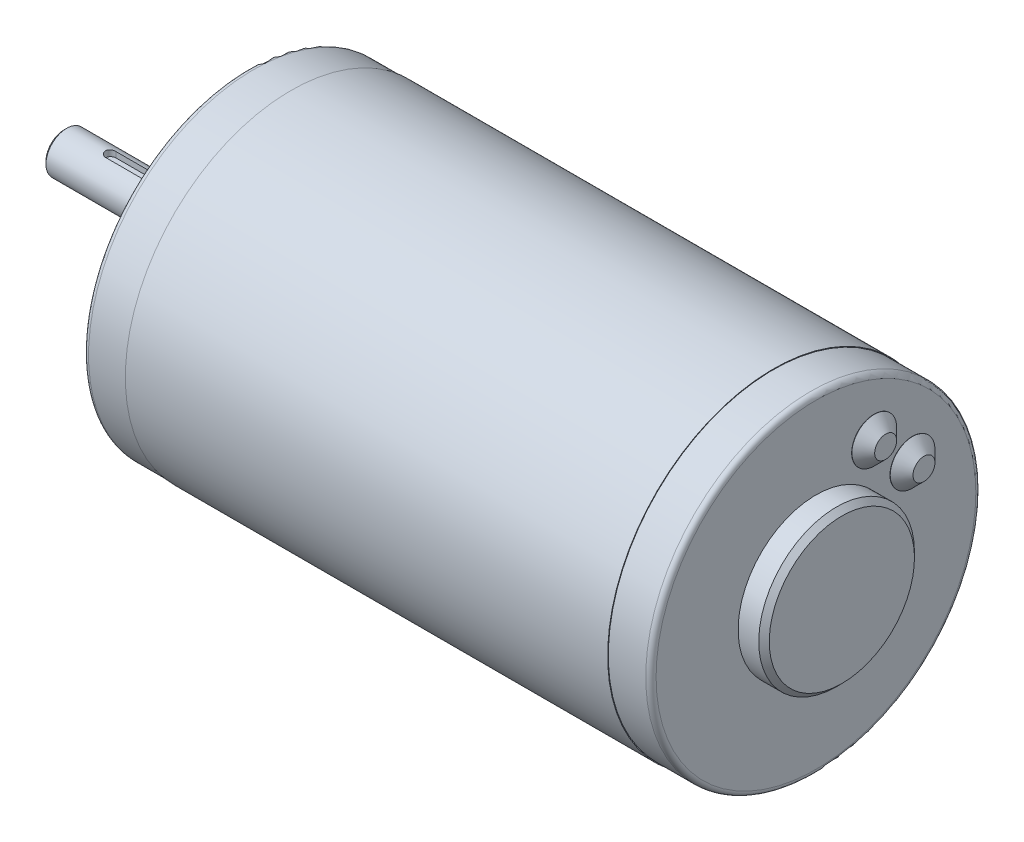
ISO-10303-21;
HEADER;
FILE_DESCRIPTION(('STEP AP214'),'2;1');
FILE_NAME('part.step','',(''),(''),'','','');
FILE_SCHEMA(('AUTOMOTIVE_DESIGN { 1 0 10303 214 1 1 1 1 }'));
ENDSEC;
DATA;
#1=APPLICATION_CONTEXT('core data for automotive mechanical design processes');
#2=APPLICATION_PROTOCOL_DEFINITION('international standard','automotive_design',2000,#1);
#3=PRODUCT_CONTEXT('',#1,'mechanical');
#4=PRODUCT('Part','Part','',(#3));
#5=PRODUCT_RELATED_PRODUCT_CATEGORY('part','',(#4));
#6=PRODUCT_DEFINITION_FORMATION('','',#4);
#7=PRODUCT_DEFINITION_CONTEXT('part definition',#1,'design');
#8=PRODUCT_DEFINITION('design','',#6,#7);
#9=PRODUCT_DEFINITION_SHAPE('','',#8);
#10=(LENGTH_UNIT() NAMED_UNIT(*) SI_UNIT(.MILLI.,.METRE.));
#11=(NAMED_UNIT(*) PLANE_ANGLE_UNIT() SI_UNIT($,.RADIAN.));
#12=(NAMED_UNIT(*) SI_UNIT($,.STERADIAN.) SOLID_ANGLE_UNIT());
#13=UNCERTAINTY_MEASURE_WITH_UNIT(LENGTH_MEASURE(1.E-05),#10,'distance_accuracy_value','');
#14=(GEOMETRIC_REPRESENTATION_CONTEXT(3) GLOBAL_UNCERTAINTY_ASSIGNED_CONTEXT((#13)) GLOBAL_UNIT_ASSIGNED_CONTEXT((#10,
#11,#12)) REPRESENTATION_CONTEXT('',''));
#15=CARTESIAN_POINT('',(0.,0.,0.));
#16=DIRECTION('',(0.,0.,1.));
#17=DIRECTION('',(1.,0.,0.));
#18=AXIS2_PLACEMENT_3D('',#15,#16,#17);
#19=CARTESIAN_POINT('',(-27.6,2.79999999999999,-1.));
#20=DIRECTION('',(0.,-1.,0.));
#21=DIRECTION('',(0.,0.,-1.));
#22=AXIS2_PLACEMENT_3D('',#19,#20,#21);
#23=PLANE('',#22);
#24=CARTESIAN_POINT('',(-7.1,2.79999999999999,0.));
#25=DIRECTION('',(0.,1.,0.));
#26=DIRECTION('',(0.,0.,1.));
#27=AXIS2_PLACEMENT_3D('',#24,#25,#26);
#28=CIRCLE('',#27,1.);
#29=CARTESIAN_POINT('',(-7.1,2.79999999999999,1.));
#30=VERTEX_POINT('',#29);
#31=CARTESIAN_POINT('',(-7.1,2.79999999999999,-1.));
#32=VERTEX_POINT('',#31);
#33=EDGE_CURVE('E81',#30,#32,#28,.T.);
#34=ORIENTED_EDGE('',*,*,#33,.T.);
#35=DIRECTION('',(1.,0.,0.));
#36=VECTOR('',#35,1.);
#37=CARTESIAN_POINT('',(-27.6,2.79999999999999,-1.));
#38=LINE('',#37,#36);
#39=CARTESIAN_POINT('',(-26.6,2.79999999999999,-1.));
#40=VERTEX_POINT('',#39);
#41=EDGE_CURVE('E76',#40,#32,#38,.T.);
#42=ORIENTED_EDGE('',*,*,#41,.F.);
#43=CARTESIAN_POINT('',(-26.6,2.79999999999999,0.));
#44=DIRECTION('',(0.,-1.,0.));
#45=DIRECTION('',(0.,0.,-1.));
#46=AXIS2_PLACEMENT_3D('',#43,#44,#45);
#47=CIRCLE('',#46,1.);
#48=CARTESIAN_POINT('',(-26.6,2.79999999999999,1.));
#49=VERTEX_POINT('',#48);
#50=EDGE_CURVE('E78',#40,#49,#47,.F.);
#51=ORIENTED_EDGE('',*,*,#50,.T.);
#52=DIRECTION('',(1.,0.,0.));
#53=VECTOR('',#52,1.);
#54=CARTESIAN_POINT('',(-27.6,2.79999999999999,1.));
#55=LINE('',#54,#53);
#56=EDGE_CURVE('E104',#49,#30,#55,.T.);
#57=ORIENTED_EDGE('',*,*,#56,.T.);
#58=EDGE_LOOP('',(#34,#42,#51,#57));
#59=FACE_BOUND('',#58,.T.);
#60=ADVANCED_FACE('F18',(#59),#23,.F.);
#61=CARTESIAN_POINT('',(-35.6,0.,0.));
#62=DIRECTION('',(-1.,0.,0.));
#63=DIRECTION('',(0.,0.,1.));
#64=AXIS2_PLACEMENT_3D('',#61,#62,#63);
#65=PLANE('',#64);
#66=CARTESIAN_POINT('',(-35.6000000000449,0.,0.));
#67=DIRECTION('',(1.,0.,0.));
#68=DIRECTION('',(0.,0.,-1.));
#69=AXIS2_PLACEMENT_3D('',#66,#67,#68);
#70=CIRCLE('',#69,3.49999999997408);
#71=CARTESIAN_POINT('',(-35.6000000000449,0.,-3.49999999997408));
#72=VERTEX_POINT('',#71);
#73=EDGE_CURVE('E326',#72,#72,#70,.T.);
#74=ORIENTED_EDGE('',*,*,#73,.F.);
#75=EDGE_LOOP('',(#74));
#76=FACE_BOUND('',#75,.T.);
#77=ADVANCED_FACE('F612',(#76),#65,.T.);
#78=CARTESIAN_POINT('',(-26.6,3.87298334620741,0.));
#79=DIRECTION('',(0.,-1.,0.));
#80=DIRECTION('',(0.,0.,-1.));
#81=AXIS2_PLACEMENT_3D('',#78,#79,#80);
#82=CYLINDRICAL_SURFACE('',#81,1.);
#83=CARTESIAN_POINT('',(-26.6,3.87298334620741,1.));
#84=CARTESIAN_POINT('',(-26.6276629851065,3.87298148580177,1.00000033749611));
#85=CARTESIAN_POINT('',(-26.6553122630182,3.8732800994947,0.998851407375366));
#86=CARTESIAN_POINT('',(-26.7104040353036,3.87445904774558,0.994271295395754));
#87=CARTESIAN_POINT('',(-26.7378465636871,3.87533928441687,0.990840497572679));
#88=CARTESIAN_POINT('',(-26.8194531732088,3.87881710972053,0.977175239382526));
#89=CARTESIAN_POINT('',(-26.8730564684822,3.88225203148808,0.963567695172493));
#90=CARTESIAN_POINT('',(-26.977124673782,3.89095422588002,0.927798076247996));
#91=CARTESIAN_POINT('',(-27.0275898782129,3.89622132630929,0.905636805423835));
#92=CARTESIAN_POINT('',(-27.1241114486473,3.90799134471939,0.853415378025864));
#93=CARTESIAN_POINT('',(-27.170166627891,3.91449459395647,0.823353103356932));
#94=CARTESIAN_POINT('',(-27.2575438819061,3.92816262398025,0.755484471828069));
#95=CARTESIAN_POINT('',(-27.2987548862455,3.93533791028915,0.717537268783975));
#96=CARTESIAN_POINT('',(-27.3743020894827,3.94945104396193,0.635275780516229));
#97=CARTESIAN_POINT('',(-27.4086371894679,3.95638885322537,0.59096047947883));
#98=CARTESIAN_POINT('',(-27.4699110016186,3.96936182283248,0.496456899401689));
#99=CARTESIAN_POINT('',(-27.496739895984,3.9753830468173,0.446195340334472));
#100=CARTESIAN_POINT('',(-27.5415247341967,3.98572346250588,0.341702590842916));
#101=CARTESIAN_POINT('',(-27.5594824242998,3.990042989147,0.287472184083007));
#102=CARTESIAN_POINT('',(-27.5856589927774,3.99641900005128,0.177744108525158));
#103=CARTESIAN_POINT('',(-27.5940676724228,3.998519529013,0.122294322002856));
#104=CARTESIAN_POINT('',(-27.6015033715433,4.00037438150815,0.0107327756816781));
#105=CARTESIAN_POINT('',(-27.6005315701923,4.00012899993444,-0.0453789000287067));
#106=CARTESIAN_POINT('',(-27.5893700363146,3.99735237365735,-0.155352492972096));
#107=CARTESIAN_POINT('',(-27.5793853834005,3.9948719867736,-0.209236701739855));
#108=CARTESIAN_POINT('',(-27.5508113208173,3.98796330636495,-0.31453871108434));
#109=CARTESIAN_POINT('',(-27.5322215304314,3.98353492665556,-0.365956402423988));
#110=CARTESIAN_POINT('',(-27.4867987193294,3.97314997761798,-0.46540728602454));
#111=CARTESIAN_POINT('',(-27.4598926057672,3.96717993827555,-0.513405629602248));
#112=CARTESIAN_POINT('',(-27.3986568701665,3.95435945541919,-0.604276631230015));
#113=CARTESIAN_POINT('',(-27.3643261297468,3.94750887933198,-0.64714851556229));
#114=CARTESIAN_POINT('',(-27.2881210879187,3.93345566022865,-0.727769389708492));
#115=CARTESIAN_POINT('',(-27.2460683634602,3.92624850477685,-0.765349103054128));
#116=CARTESIAN_POINT('',(-27.1561701330723,3.91246168284006,-0.832969575186237));
#117=CARTESIAN_POINT('',(-27.1083230467164,3.90588218842993,-0.863008270245062));
#118=CARTESIAN_POINT('',(-27.0078544021762,3.89407813586325,-0.914804709285961));
#119=CARTESIAN_POINT('',(-26.9552085351039,3.88886106009136,-0.936517017887269));
#120=CARTESIAN_POINT('',(-26.8468830715817,3.88047058807054,-0.970702351849828));
#121=CARTESIAN_POINT('',(-26.7912081448502,3.87729413761435,-0.983189189212131));
#122=CARTESIAN_POINT('',(-26.7125426192411,3.87455290681524,-0.993904635150938));
#123=CARTESIAN_POINT('',(-26.6900802967868,3.87396523110859,-0.996190790966708));
#124=CARTESIAN_POINT('',(-26.6450822100907,3.87318062488974,-0.999236757697394));
#125=CARTESIAN_POINT('',(-26.6225466240447,3.87298306219461,-0.999999038096045));
#126=CARTESIAN_POINT('',(-26.6,3.87298334620741,-1.));
#127=B_SPLINE_CURVE_WITH_KNOTS('',3,(#83,#84,#85,#86,#87,#88,#89,#90,#91,#92,#93,#94,#95,#96,
#97,#98,#99,#100,#101,#102,#103,#104,#105,#106,#107,#108,#109,#110,#111,#112,#113,#114,#115,
#116,#117,#118,#119,#120,#121,#122,#123,#124,#125,#126),.UNSPECIFIED.,.F.,.F.,(4,2,2,2,2,2,2,2,
2,2,2,2,2,2,2,2,2,2,2,2,2,4),(0.,0.0829365303397727,0.165859106084653,0.331229963080318,
0.496585282091499,0.661984974726751,0.830641897427976,0.999325753539196,1.17036187098235,
1.34136430732425,1.50890481515325,1.67642426256639,1.84022545479276,2.00403389475838,
2.16932509450376,2.33464120964329,2.50441429534542,2.67423379180967,2.84496720161068,
3.01544447539986,3.08315848722649,3.15076267731671),.UNSPECIFIED.);
#128=CARTESIAN_POINT('',(-26.6,3.87298334620741,1.));
#129=VERTEX_POINT('',#128);
#130=CARTESIAN_POINT('',(-26.6,3.87298334620741,-1.));
#131=VERTEX_POINT('',#130);
#132=EDGE_CURVE('E162',#129,#131,#127,.T.);
#133=ORIENTED_EDGE('',*,*,#132,.F.);
#134=DIRECTION('',(0.,1.,0.));
#135=VECTOR('',#134,1.);
#136=CARTESIAN_POINT('',(-26.6,2.79999999999999,1.));
#137=LINE('',#136,#135);
#138=EDGE_CURVE('E91',#129,#49,#137,.F.);
#139=ORIENTED_EDGE('',*,*,#138,.T.);
#140=ORIENTED_EDGE('',*,*,#50,.F.);
#141=DIRECTION('',(0.,1.,0.));
#142=VECTOR('',#141,1.);
#143=CARTESIAN_POINT('',(-26.6,2.79999999999999,-1.));
#144=LINE('',#143,#142);
#145=EDGE_CURVE('E85',#131,#40,#144,.F.);
#146=ORIENTED_EDGE('',*,*,#145,.F.);
#147=EDGE_LOOP('',(#133,#139,#140,#146));
#148=FACE_BOUND('',#147,.T.);
#149=ADVANCED_FACE('F88',(#148),#82,.F.);
#150=CARTESIAN_POINT('',(-27.6,2.79999999999999,-1.));
#151=DIRECTION('',(0.,0.,1.));
#152=DIRECTION('',(1.,0.,0.));
#153=AXIS2_PLACEMENT_3D('',#150,#151,#152);
#154=PLANE('',#153);
#155=DIRECTION('',(1.,0.,0.));
#156=VECTOR('',#155,1.);
#157=CARTESIAN_POINT('',(0.,3.87298334620741,-1.));
#158=LINE('',#157,#156);
#159=CARTESIAN_POINT('',(-7.1,3.87298334620741,-1.));
#160=VERTEX_POINT('',#159);
#161=EDGE_CURVE('E96',#131,#160,#158,.T.);
#162=ORIENTED_EDGE('',*,*,#161,.F.);
#163=ORIENTED_EDGE('',*,*,#145,.T.);
#164=ORIENTED_EDGE('',*,*,#41,.T.);
#165=DIRECTION('',(0.,1.,0.));
#166=VECTOR('',#165,1.);
#167=CARTESIAN_POINT('',(-7.1,2.79999999999999,-1.));
#168=LINE('',#167,#166);
#169=EDGE_CURVE('E99',#32,#160,#168,.T.);
#170=ORIENTED_EDGE('',*,*,#169,.T.);
#171=EDGE_LOOP('',(#162,#163,#164,#170));
#172=FACE_BOUND('',#171,.T.);
#173=ADVANCED_FACE('F94',(#172),#154,.T.);
#174=CARTESIAN_POINT('',(-7.1,2.79999999999999,0.));
#175=DIRECTION('',(0.,1.,0.));
#176=DIRECTION('',(0.,0.,1.));
#177=AXIS2_PLACEMENT_3D('',#174,#175,#176);
#178=CYLINDRICAL_SURFACE('',#177,1.);
#179=ORIENTED_EDGE('',*,*,#33,.F.);
#180=DIRECTION('',(0.,1.,0.));
#181=VECTOR('',#180,1.);
#182=CARTESIAN_POINT('',(-7.1,2.79999999999999,1.));
#183=LINE('',#182,#181);
#184=CARTESIAN_POINT('',(-7.1,3.87298334620741,1.));
#185=VERTEX_POINT('',#184);
#186=EDGE_CURVE('E105',#30,#185,#183,.T.);
#187=ORIENTED_EDGE('',*,*,#186,.T.);
#188=CARTESIAN_POINT('',(-7.1,3.87298334620741,-1.));
#189=CARTESIAN_POINT('',(-7.07233701489346,3.87298148580177,-1.00000033749611));
#190=CARTESIAN_POINT('',(-7.04468773698177,3.8732800994947,-0.998851407375366));
#191=CARTESIAN_POINT('',(-6.98959596469644,3.87445904774558,-0.994271295395754));
#192=CARTESIAN_POINT('',(-6.96215343631291,3.87533928441687,-0.990840497572679));
#193=CARTESIAN_POINT('',(-6.88054682679116,3.87881710972053,-0.977175239382526));
#194=CARTESIAN_POINT('',(-6.82694353151779,3.88225203148808,-0.963567695172493));
#195=CARTESIAN_POINT('',(-6.72287532621804,3.89095422588002,-0.927798076247997));
#196=CARTESIAN_POINT('',(-6.67241012178714,3.89622132630929,-0.905636805423836));
#197=CARTESIAN_POINT('',(-6.57588855135267,3.90799134471939,-0.853415378025865));
#198=CARTESIAN_POINT('',(-6.52983337210904,3.91449459395647,-0.823353103356933));
#199=CARTESIAN_POINT('',(-6.4424561180939,3.92816262398025,-0.755484471828069));
#200=CARTESIAN_POINT('',(-6.40124511375448,3.93533791028915,-0.717537268783976));
#201=CARTESIAN_POINT('',(-6.32569791051729,3.94945104396193,-0.63527578051623));
#202=CARTESIAN_POINT('',(-6.29136281053206,3.95638885322537,-0.590960479478831));
#203=CARTESIAN_POINT('',(-6.23008899838136,3.96936182283248,-0.496456899401691));
#204=CARTESIAN_POINT('',(-6.20326010401603,3.9753830468173,-0.446195340334474));
#205=CARTESIAN_POINT('',(-6.1584752658033,3.98572346250588,-0.341702590842919));
#206=CARTESIAN_POINT('',(-6.14051757570017,3.990042989147,-0.28747218408301));
#207=CARTESIAN_POINT('',(-6.11434100722257,3.99641900005128,-0.17774410852516));
#208=CARTESIAN_POINT('',(-6.10593232757718,3.998519529013,-0.122294322002858));
#209=CARTESIAN_POINT('',(-6.09849662845671,4.00037438150815,-0.0107327756816796));
#210=CARTESIAN_POINT('',(-6.09946842980766,4.00012899993444,0.0453789000287057));
#211=CARTESIAN_POINT('',(-6.11062996368545,3.99735237365735,0.155352492972096));
#212=CARTESIAN_POINT('',(-6.12061461659948,3.9948719867736,0.209236701739855));
#213=CARTESIAN_POINT('',(-6.14918867918275,3.98796330636495,0.31453871108434));
#214=CARTESIAN_POINT('',(-6.16777846956858,3.98353492665556,0.365956402423988));
#215=CARTESIAN_POINT('',(-6.21320128067065,3.97314997761798,0.465407286024539));
#216=CARTESIAN_POINT('',(-6.24010739423284,3.96717993827555,0.513405629602248));
#217=CARTESIAN_POINT('',(-6.30134312983347,3.95435945541919,0.604276631230014));
#218=CARTESIAN_POINT('',(-6.33567387025322,3.94750887933198,0.647148515562289));
#219=CARTESIAN_POINT('',(-6.41187891208131,3.93345566022865,0.72776938970849));
#220=CARTESIAN_POINT('',(-6.45393163653981,3.92624850477685,0.765349103054127));
#221=CARTESIAN_POINT('',(-6.54382986692773,3.91246168284006,0.832969575186237));
#222=CARTESIAN_POINT('',(-6.59167695328356,3.90588218842993,0.863008270245062));
#223=CARTESIAN_POINT('',(-6.69214559782377,3.89407813586325,0.914804709285962));
#224=CARTESIAN_POINT('',(-6.74479146489609,3.88886106009136,0.936517017887269));
#225=CARTESIAN_POINT('',(-6.85311692841829,3.88047058807055,0.970702351849829));
#226=CARTESIAN_POINT('',(-6.90879185514984,3.87729413761435,0.983189189212132));
#227=CARTESIAN_POINT('',(-6.9874573807589,3.87455290681524,0.993904635150938));
#228=CARTESIAN_POINT('',(-7.00991970321318,3.87396523110859,0.996190790966708));
#229=CARTESIAN_POINT('',(-7.05491778990932,3.87318062488974,0.999236757697394));
#230=CARTESIAN_POINT('',(-7.07745337595529,3.87298306219461,0.999999038096045));
#231=CARTESIAN_POINT('',(-7.1,3.87298334620741,1.));
#232=B_SPLINE_CURVE_WITH_KNOTS('',3,(#188,#189,#190,#191,#192,#193,#194,#195,#196,#197,#198,
#199,#200,#201,#202,#203,#204,#205,#206,#207,#208,#209,#210,#211,#212,#213,#214,#215,#216,#217,
#218,#219,#220,#221,#222,#223,#224,#225,#226,#227,#228,#229,#230,#231),.UNSPECIFIED.,.F.,.F.,(4,
2,2,2,2,2,2,2,2,2,2,2,2,2,2,2,2,2,2,2,2,4),(0.,0.0829365303397693,0.165859106084651,
0.331229963080317,0.496585282091498,0.661984974726749,0.830641897427974,0.999325753539193,
1.17036187098235,1.34136430732424,1.50890481515325,1.67642426256639,1.84022545479276,
2.00403389475838,2.16932509450376,2.33464120964329,2.50441429534542,2.67423379180967,
2.84496720161068,3.01544447539986,3.08315848722648,3.15076267731671),.UNSPECIFIED.);
#233=EDGE_CURVE('E153',#160,#185,#232,.T.);
#234=ORIENTED_EDGE('',*,*,#233,.F.);
#235=ORIENTED_EDGE('',*,*,#169,.F.);
#236=EDGE_LOOP('',(#179,#187,#234,#235));
#237=FACE_BOUND('',#236,.T.);
#238=ADVANCED_FACE('F168',(#237),#178,.F.);
#239=CARTESIAN_POINT('',(-27.6,2.79999999999999,1.));
#240=DIRECTION('',(0.,0.,1.));
#241=DIRECTION('',(1.,0.,0.));
#242=AXIS2_PLACEMENT_3D('',#239,#240,#241);
#243=PLANE('',#242);
#244=ORIENTED_EDGE('',*,*,#186,.F.);
#245=ORIENTED_EDGE('',*,*,#56,.F.);
#246=ORIENTED_EDGE('',*,*,#138,.F.);
#247=DIRECTION('',(1.,0.,0.));
#248=VECTOR('',#247,1.);
#249=CARTESIAN_POINT('',(0.,3.87298334620741,1.));
#250=LINE('',#249,#248);
#251=EDGE_CURVE('E161',#185,#129,#250,.F.);
#252=ORIENTED_EDGE('',*,*,#251,.F.);
#253=EDGE_LOOP('',(#244,#245,#246,#252));
#254=FACE_BOUND('',#253,.T.);
#255=ADVANCED_FACE('F183',(#254),#243,.F.);
#256=CARTESIAN_POINT('',(-35.0999999999999,0.,0.));
#257=DIRECTION('',(1.,0.,0.));
#258=DIRECTION('',(0.,0.,-1.));
#259=AXIS2_PLACEMENT_3D('',#256,#257,#258);
#260=CONICAL_SURFACE('',#259,3.99999999996226,0.785398163340605);
#261=ORIENTED_EDGE('',*,*,#73,.T.);
#262=EDGE_LOOP('',(#261));
#263=FACE_BOUND('',#262,.T.);
#264=CARTESIAN_POINT('',(-35.1,0.,0.));
#265=DIRECTION('',(1.,0.,0.));
#266=DIRECTION('',(0.,0.,-1.));
#267=AXIS2_PLACEMENT_3D('',#264,#265,#266);
#268=CIRCLE('',#267,4.);
#269=CARTESIAN_POINT('',(-35.1,0.,-4.));
#270=VERTEX_POINT('',#269);
#271=EDGE_CURVE('E152',#270,#270,#268,.T.);
#272=ORIENTED_EDGE('',*,*,#271,.F.);
#273=EDGE_LOOP('',(#272));
#274=FACE_BOUND('',#273,.T.);
#275=ADVANCED_FACE('F178',(#263,#274),#260,.T.);
#276=CARTESIAN_POINT('',(0.,0.,0.));
#277=DIRECTION('',(1.,0.,0.));
#278=DIRECTION('',(0.,0.,-1.));
#279=AXIS2_PLACEMENT_3D('',#276,#277,#278);
#280=CYLINDRICAL_SURFACE('',#279,4.);
#281=ORIENTED_EDGE('',*,*,#271,.T.);
#282=EDGE_LOOP('',(#281));
#283=FACE_BOUND('',#282,.T.);
#284=CARTESIAN_POINT('',(-4.,0.,0.));
#285=DIRECTION('',(1.,0.,0.));
#286=DIRECTION('',(0.,0.,-1.));
#287=AXIS2_PLACEMENT_3D('',#284,#285,#286);
#288=CIRCLE('',#287,4.);
#289=CARTESIAN_POINT('',(-4.,0.,-4.));
#290=VERTEX_POINT('',#289);
#291=EDGE_CURVE('E149',#290,#290,#288,.T.);
#292=ORIENTED_EDGE('',*,*,#291,.F.);
#293=EDGE_LOOP('',(#292));
#294=FACE_BOUND('',#293,.T.);
#295=ORIENTED_EDGE('',*,*,#233,.T.);
#296=ORIENTED_EDGE('',*,*,#251,.T.);
#297=ORIENTED_EDGE('',*,*,#132,.T.);
#298=ORIENTED_EDGE('',*,*,#161,.T.);
#299=EDGE_LOOP('',(#295,#296,#297,#298));
#300=FACE_BOUND('',#299,.T.);
#301=ADVANCED_FACE('F172',(#283,#294,#300),#280,.T.);
#302=CARTESIAN_POINT('',(-4.,4.,0.));
#303=DIRECTION('',(-1.,0.,0.));
#304=DIRECTION('',(0.,0.,1.));
#305=AXIS2_PLACEMENT_3D('',#302,#303,#304);
#306=PLANE('',#305);
#307=ORIENTED_EDGE('',*,*,#291,.T.);
#308=EDGE_LOOP('',(#307));
#309=FACE_BOUND('',#308,.T.);
#310=CARTESIAN_POINT('',(-4.,0.,0.));
#311=DIRECTION('',(1.,0.,0.));
#312=DIRECTION('',(0.,1.,0.));
#313=AXIS2_PLACEMENT_3D('',#310,#311,#312);
#314=CIRCLE('',#313,8.509);
#315=CARTESIAN_POINT('',(-4.,8.509,0.));
#316=VERTEX_POINT('',#315);
#317=EDGE_CURVE('E146',#316,#316,#314,.T.);
#318=ORIENTED_EDGE('',*,*,#317,.F.);
#319=EDGE_LOOP('',(#318));
#320=FACE_BOUND('',#319,.T.);
#321=ADVANCED_FACE('F177',(#309,#320),#306,.T.);
#322=CARTESIAN_POINT('',(111.8479,18.6070906828553,-11.2073596390943));
#323=DIRECTION('',(1.,0.,0.));
#324=DIRECTION('',(0.,0.,-1.));
#325=AXIS2_PLACEMENT_3D('',#322,#323,#324);
#326=PLANE('',#325);
#327=CARTESIAN_POINT('',(111.84789999993,18.6070906828553,-11.2073596390943));
#328=DIRECTION('',(-1.,0.,0.));
#329=DIRECTION('',(0.,-1.,0.));
#330=AXIS2_PLACEMENT_3D('',#327,#328,#329);
#331=CIRCLE('',#330,2.11800000003146);
#332=CARTESIAN_POINT('',(111.84789999993,16.4890906828238,-11.2073596390943));
#333=VERTEX_POINT('',#332);
#334=EDGE_CURVE('E143',#333,#333,#331,.T.);
#335=ORIENTED_EDGE('',*,*,#334,.F.);
#336=EDGE_LOOP('',(#335));
#337=FACE_BOUND('',#336,.T.);
#338=ADVANCED_FACE('F399',(#337),#326,.T.);
#339=CARTESIAN_POINT('',(114.6,15.0368,0.));
#340=DIRECTION('',(1.,0.,0.));
#341=DIRECTION('',(0.,0.,-1.));
#342=AXIS2_PLACEMENT_3D('',#339,#340,#341);
#343=PLANE('',#342);
#344=CARTESIAN_POINT('',(114.6,0.,0.));
#345=DIRECTION('',(-1.,0.,0.));
#346=DIRECTION('',(0.,-1.,0.));
#347=AXIS2_PLACEMENT_3D('',#344,#345,#346);
#348=CIRCLE('',#347,14.0208);
#349=CARTESIAN_POINT('',(114.6,-14.0208,0.));
#350=VERTEX_POINT('',#349);
#351=EDGE_CURVE('E140',#350,#350,#348,.T.);
#352=ORIENTED_EDGE('',*,*,#351,.F.);
#353=EDGE_LOOP('',(#352));
#354=FACE_BOUND('',#353,.T.);
#355=ADVANCED_FACE('F393',(#354),#343,.T.);
#356=CARTESIAN_POINT('',(111.8479,11.2073596390943,-18.6070906828553));
#357=DIRECTION('',(1.,0.,0.));
#358=DIRECTION('',(0.,0.,-1.));
#359=AXIS2_PLACEMENT_3D('',#356,#357,#358);
#360=PLANE('',#359);
#361=CARTESIAN_POINT('',(111.84789999993,11.2073596390943,-18.6070906828553));
#362=DIRECTION('',(-1.,0.,0.));
#363=DIRECTION('',(0.,0.,1.));
#364=AXIS2_PLACEMENT_3D('',#361,#362,#363);
#365=CIRCLE('',#364,2.1180000000021);
#366=CARTESIAN_POINT('',(111.84789999993,11.2073596390943,-16.4890906828532));
#367=VERTEX_POINT('',#366);
#368=EDGE_CURVE('E136',#367,#367,#365,.T.);
#369=ORIENTED_EDGE('',*,*,#368,.F.);
#370=EDGE_LOOP('',(#369));
#371=FACE_BOUND('',#370,.T.);
#372=ADVANCED_FACE('F398',(#371),#360,.T.);
#373=CARTESIAN_POINT('',(13.6143999999945,25.4,0.));
#374=DIRECTION('',(-1.,0.,0.));
#375=DIRECTION('',(0.,0.,1.));
#376=AXIS2_PLACEMENT_3D('',#373,#374,#375);
#377=CONICAL_SURFACE('',#376,2.01929999997219,1.02974425867198);
#378=CARTESIAN_POINT('',(14.827717847993,25.4,0.));
#379=VERTEX_POINT('',#378);
#380=VERTEX_LOOP('',#379);
#381=FACE_BOUND('',#380,.T.);
#382=CARTESIAN_POINT('',(13.6144,25.4,0.));
#383=DIRECTION('',(-1.,0.,0.));
#384=DIRECTION('',(0.,0.,1.));
#385=AXIS2_PLACEMENT_3D('',#382,#383,#384);
#386=CIRCLE('',#385,2.0193);
#387=CARTESIAN_POINT('',(13.6144,25.4,2.0193));
#388=VERTEX_POINT('',#387);
#389=EDGE_CURVE('E139',#388,#388,#386,.T.);
#390=ORIENTED_EDGE('',*,*,#389,.T.);
#391=EDGE_LOOP('',(#390));
#392=FACE_BOUND('',#391,.T.);
#393=ADVANCED_FACE('F547',(#381,#392),#377,.F.);
#394=CARTESIAN_POINT('',(13.6143999999945,-25.4,0.));
#395=DIRECTION('',(-1.,0.,0.));
#396=DIRECTION('',(0.,0.,1.));
#397=AXIS2_PLACEMENT_3D('',#394,#395,#396);
#398=CONICAL_SURFACE('',#397,2.01929999997219,1.02974425867198);
#399=CARTESIAN_POINT('',(14.827717847993,-25.4,0.));
#400=VERTEX_POINT('',#399);
#401=VERTEX_LOOP('',#400);
#402=FACE_BOUND('',#401,.T.);
#403=CARTESIAN_POINT('',(13.6144,-25.4,0.));
#404=DIRECTION('',(-1.,0.,0.));
#405=DIRECTION('',(0.,0.,1.));
#406=AXIS2_PLACEMENT_3D('',#403,#404,#405);
#407=CIRCLE('',#406,2.0193);
#408=CARTESIAN_POINT('',(13.6144,-25.4,2.0193));
#409=VERTEX_POINT('',#408);
#410=EDGE_CURVE('E316',#409,#409,#407,.T.);
#411=ORIENTED_EDGE('',*,*,#410,.T.);
#412=EDGE_LOOP('',(#411));
#413=FACE_BOUND('',#412,.T.);
#414=ADVANCED_FACE('F537',(#402,#413),#398,.F.);
#415=CARTESIAN_POINT('',(-2.984,0.,0.));
#416=DIRECTION('',(1.,0.,0.));
#417=DIRECTION('',(0.,1.,0.));
#418=AXIS2_PLACEMENT_3D('',#415,#416,#417);
#419=CONICAL_SURFACE('',#418,9.525,0.78539816339745);
#420=ORIENTED_EDGE('',*,*,#317,.T.);
#421=EDGE_LOOP('',(#420));
#422=FACE_BOUND('',#421,.T.);
#423=CARTESIAN_POINT('',(-2.984,0.,0.));
#424=DIRECTION('',(1.,0.,0.));
#425=DIRECTION('',(0.,0.,-1.));
#426=AXIS2_PLACEMENT_3D('',#423,#424,#425);
#427=CIRCLE('',#426,9.525);
#428=CARTESIAN_POINT('',(-2.984,0.,-9.525));
#429=VERTEX_POINT('',#428);
#430=EDGE_CURVE('E313',#429,#429,#427,.T.);
#431=ORIENTED_EDGE('',*,*,#430,.F.);
#432=EDGE_LOOP('',(#431));
#433=FACE_BOUND('',#432,.T.);
#434=ADVANCED_FACE('F528',(#422,#433),#419,.T.);
#435=CARTESIAN_POINT('',(109.647900000027,18.6070906828553,-11.2073596390943));
#436=DIRECTION('',(-1.,0.,0.));
#437=DIRECTION('',(0.,-1.,0.));
#438=AXIS2_PLACEMENT_3D('',#435,#436,#437);
#439=CONICAL_SURFACE('',#438,4.31799999987712,0.785398163384529);
#440=CARTESIAN_POINT('',(109.6479,18.6070906828553,-11.2073596390943));
#441=DIRECTION('',(-1.,0.,0.));
#442=DIRECTION('',(0.,0.,1.));
#443=AXIS2_PLACEMENT_3D('',#440,#441,#442);
#444=CIRCLE('',#443,4.318);
#445=CARTESIAN_POINT('',(109.6479,18.6070906828553,-6.88935963909434));
#446=VERTEX_POINT('',#445);
#447=EDGE_CURVE('E310',#446,#446,#444,.T.);
#448=ORIENTED_EDGE('',*,*,#447,.F.);
#449=EDGE_LOOP('',(#448));
#450=FACE_BOUND('',#449,.T.);
#451=ORIENTED_EDGE('',*,*,#334,.T.);
#452=EDGE_LOOP('',(#451));
#453=FACE_BOUND('',#452,.T.);
#454=ADVANCED_FACE('F415',(#450,#453),#439,.T.);
#455=CARTESIAN_POINT('',(113.584,0.,0.));
#456=DIRECTION('',(-1.,0.,0.));
#457=DIRECTION('',(0.,-1.,0.));
#458=AXIS2_PLACEMENT_3D('',#455,#456,#457);
#459=CONICAL_SURFACE('',#458,15.0368,0.785398163397441);
#460=ORIENTED_EDGE('',*,*,#351,.T.);
#461=EDGE_LOOP('',(#460));
#462=FACE_BOUND('',#461,.T.);
#463=CARTESIAN_POINT('',(113.584,0.,0.));
#464=DIRECTION('',(1.,0.,0.));
#465=DIRECTION('',(0.,0.,-1.));
#466=AXIS2_PLACEMENT_3D('',#463,#464,#465);
#467=CIRCLE('',#466,15.0368);
#468=CARTESIAN_POINT('',(113.584,0.,-15.0368));
#469=VERTEX_POINT('',#468);
#470=EDGE_CURVE('E307',#469,#469,#467,.F.);
#471=ORIENTED_EDGE('',*,*,#470,.F.);
#472=EDGE_LOOP('',(#471));
#473=FACE_BOUND('',#472,.T.);
#474=ADVANCED_FACE('F409',(#462,#473),#459,.T.);
#475=CARTESIAN_POINT('',(109.647900000084,11.2073596390943,-18.6070906828553));
#476=DIRECTION('',(-1.,0.,0.));
#477=DIRECTION('',(0.,0.,1.));
#478=AXIS2_PLACEMENT_3D('',#475,#476,#477);
#479=CONICAL_SURFACE('',#478,4.31799999990461,0.785398163410367);
#480=CARTESIAN_POINT('',(109.6479,11.2073596390943,-18.6070906828553));
#481=DIRECTION('',(-1.,0.,0.));
#482=DIRECTION('',(0.,0.,1.));
#483=AXIS2_PLACEMENT_3D('',#480,#481,#482);
#484=CIRCLE('',#483,4.318);
#485=CARTESIAN_POINT('',(109.6479,11.2073596390943,-14.2890906828553));
#486=VERTEX_POINT('',#485);
#487=EDGE_CURVE('E135',#486,#486,#484,.T.);
#488=ORIENTED_EDGE('',*,*,#487,.F.);
#489=EDGE_LOOP('',(#488));
#490=FACE_BOUND('',#489,.T.);
#491=ORIENTED_EDGE('',*,*,#368,.T.);
#492=EDGE_LOOP('',(#491));
#493=FACE_BOUND('',#492,.T.);
#494=ADVANCED_FACE('F414',(#490,#493),#479,.T.);
#495=CARTESIAN_POINT('',(0.,25.4,0.));
#496=DIRECTION('',(-1.,0.,0.));
#497=DIRECTION('',(0.,0.,1.));
#498=AXIS2_PLACEMENT_3D('',#495,#496,#497);
#499=CYLINDRICAL_SURFACE('',#498,2.0193);
#500=CARTESIAN_POINT('',(0.,25.4,0.));
#501=DIRECTION('',(-1.,0.,0.));
#502=DIRECTION('',(0.,0.,1.));
#503=AXIS2_PLACEMENT_3D('',#500,#501,#502);
#504=CIRCLE('',#503,2.0193);
#505=CARTESIAN_POINT('',(0.,25.4,2.0193));
#506=VERTEX_POINT('',#505);
#507=EDGE_CURVE('E132',#506,#506,#504,.F.);
#508=ORIENTED_EDGE('',*,*,#507,.F.);
#509=EDGE_LOOP('',(#508));
#510=FACE_BOUND('',#509,.T.);
#511=ORIENTED_EDGE('',*,*,#389,.F.);
#512=EDGE_LOOP('',(#511));
#513=FACE_BOUND('',#512,.T.);
#514=ADVANCED_FACE('F505',(#510,#513),#499,.F.);
#515=CARTESIAN_POINT('',(0.,-25.4,0.));
#516=DIRECTION('',(-1.,0.,0.));
#517=DIRECTION('',(0.,0.,1.));
#518=AXIS2_PLACEMENT_3D('',#515,#516,#517);
#519=CYLINDRICAL_SURFACE('',#518,2.0193);
#520=CARTESIAN_POINT('',(0.,-25.4,0.));
#521=DIRECTION('',(-1.,0.,0.));
#522=DIRECTION('',(0.,0.,1.));
#523=AXIS2_PLACEMENT_3D('',#520,#521,#522);
#524=CIRCLE('',#523,2.0193);
#525=CARTESIAN_POINT('',(0.,-25.4,2.0193));
#526=VERTEX_POINT('',#525);
#527=EDGE_CURVE('E129',#526,#526,#524,.F.);
#528=ORIENTED_EDGE('',*,*,#527,.F.);
#529=EDGE_LOOP('',(#528));
#530=FACE_BOUND('',#529,.T.);
#531=ORIENTED_EDGE('',*,*,#410,.F.);
#532=EDGE_LOOP('',(#531));
#533=FACE_BOUND('',#532,.T.);
#534=ADVANCED_FACE('F496',(#530,#533),#519,.F.);
#535=CARTESIAN_POINT('',(0.,0.,0.));
#536=DIRECTION('',(1.,0.,0.));
#537=DIRECTION('',(0.,0.,-1.));
#538=AXIS2_PLACEMENT_3D('',#535,#536,#537);
#539=CYLINDRICAL_SURFACE('',#538,9.525);
#540=ORIENTED_EDGE('',*,*,#430,.T.);
#541=EDGE_LOOP('',(#540));
#542=FACE_BOUND('',#541,.T.);
#543=CARTESIAN_POINT('',(0.,0.,0.));
#544=DIRECTION('',(1.,0.,0.));
#545=DIRECTION('',(0.,0.,-1.));
#546=AXIS2_PLACEMENT_3D('',#543,#544,#545);
#547=CIRCLE('',#546,9.525);
#548=CARTESIAN_POINT('',(0.,0.,-9.525));
#549=VERTEX_POINT('',#548);
#550=EDGE_CURVE('E126',#549,#549,#547,.T.);
#551=ORIENTED_EDGE('',*,*,#550,.F.);
#552=EDGE_LOOP('',(#551));
#553=FACE_BOUND('',#552,.T.);
#554=ADVANCED_FACE('F487',(#542,#553),#539,.T.);
#555=CARTESIAN_POINT('',(111.8479,18.6070906828553,-11.2073596390943));
#556=DIRECTION('',(-1.,0.,0.));
#557=DIRECTION('',(0.,0.,1.));
#558=AXIS2_PLACEMENT_3D('',#555,#556,#557);
#559=CYLINDRICAL_SURFACE('',#558,4.318);
#560=CARTESIAN_POINT('',(109.6,18.6070906828553,-11.2073596390943));
#561=DIRECTION('',(-1.,0.,0.));
#562=DIRECTION('',(0.,0.,1.));
#563=AXIS2_PLACEMENT_3D('',#560,#561,#562);
#564=CIRCLE('',#563,4.318);
#565=CARTESIAN_POINT('',(109.6,18.6070906828553,-6.88935963909434));
#566=VERTEX_POINT('',#565);
#567=EDGE_CURVE('E123',#566,#566,#564,.T.);
#568=ORIENTED_EDGE('',*,*,#567,.F.);
#569=EDGE_LOOP('',(#568));
#570=FACE_BOUND('',#569,.T.);
#571=ORIENTED_EDGE('',*,*,#447,.T.);
#572=EDGE_LOOP('',(#571));
#573=FACE_BOUND('',#572,.T.);
#574=ADVANCED_FACE('F430',(#570,#573),#559,.T.);
#575=CARTESIAN_POINT('',(0.,0.,0.));
#576=DIRECTION('',(1.,0.,0.));
#577=DIRECTION('',(0.,0.,-1.));
#578=AXIS2_PLACEMENT_3D('',#575,#576,#577);
#579=CYLINDRICAL_SURFACE('',#578,15.0368);
#580=CARTESIAN_POINT('',(109.6,0.,0.));
#581=DIRECTION('',(1.,0.,0.));
#582=DIRECTION('',(0.,0.,-1.));
#583=AXIS2_PLACEMENT_3D('',#580,#581,#582);
#584=CIRCLE('',#583,15.0368);
#585=CARTESIAN_POINT('',(109.6,0.,-15.0368));
#586=VERTEX_POINT('',#585);
#587=EDGE_CURVE('E120',#586,#586,#584,.F.);
#588=ORIENTED_EDGE('',*,*,#587,.F.);
#589=EDGE_LOOP('',(#588));
#590=FACE_BOUND('',#589,.T.);
#591=ORIENTED_EDGE('',*,*,#470,.T.);
#592=EDGE_LOOP('',(#591));
#593=FACE_BOUND('',#592,.T.);
#594=ADVANCED_FACE('F425',(#590,#593),#579,.T.);
#595=CARTESIAN_POINT('',(111.8479,11.2073596390943,-18.6070906828553));
#596=DIRECTION('',(-1.,0.,0.));
#597=DIRECTION('',(0.,0.,1.));
#598=AXIS2_PLACEMENT_3D('',#595,#596,#597);
#599=CYLINDRICAL_SURFACE('',#598,4.318);
#600=CARTESIAN_POINT('',(109.6,11.2073596390943,-18.6070906828553));
#601=DIRECTION('',(-1.,0.,0.));
#602=DIRECTION('',(0.,0.,1.));
#603=AXIS2_PLACEMENT_3D('',#600,#601,#602);
#604=CIRCLE('',#603,4.318);
#605=CARTESIAN_POINT('',(109.6,11.2073596390943,-14.2890906828553));
#606=VERTEX_POINT('',#605);
#607=EDGE_CURVE('E116',#606,#606,#604,.T.);
#608=ORIENTED_EDGE('',*,*,#607,.F.);
#609=EDGE_LOOP('',(#608));
#610=FACE_BOUND('',#609,.T.);
#611=ORIENTED_EDGE('',*,*,#487,.T.);
#612=EDGE_LOOP('',(#611));
#613=FACE_BOUND('',#612,.T.);
#614=ADVANCED_FACE('F429',(#610,#613),#599,.T.);
#615=CARTESIAN_POINT('',(0.,9.525,0.));
#616=DIRECTION('',(-1.,0.,0.));
#617=DIRECTION('',(0.,0.,1.));
#618=AXIS2_PLACEMENT_3D('',#615,#616,#617);
#619=PLANE('',#618);
#620=ORIENTED_EDGE('',*,*,#550,.T.);
#621=EDGE_LOOP('',(#620));
#622=FACE_BOUND('',#621,.T.);
#623=CARTESIAN_POINT('',(0.,0.,0.));
#624=DIRECTION('',(1.,0.,0.));
#625=DIRECTION('',(0.,0.,-1.));
#626=AXIS2_PLACEMENT_3D('',#623,#624,#625);
#627=CIRCLE('',#626,30.877);
#628=CARTESIAN_POINT('',(0.,0.,-30.877));
#629=VERTEX_POINT('',#628);
#630=CARTESIAN_POINT('',(0.,0.,30.877));
#631=VERTEX_POINT('',#630);
#632=EDGE_CURVE('E119',#629,#631,#627,.T.);
#633=ORIENTED_EDGE('',*,*,#632,.F.);
#634=CARTESIAN_POINT('',(0.,0.,0.));
#635=DIRECTION('',(1.,0.,0.));
#636=DIRECTION('',(0.,0.,1.));
#637=AXIS2_PLACEMENT_3D('',#634,#635,#636);
#638=CIRCLE('',#637,30.877);
#639=EDGE_CURVE('E286',#631,#629,#638,.T.);
#640=ORIENTED_EDGE('',*,*,#639,.F.);
#641=EDGE_LOOP('',(#633,#640));
#642=FACE_BOUND('',#641,.T.);
#643=ORIENTED_EDGE('',*,*,#527,.T.);
#644=EDGE_LOOP('',(#643));
#645=FACE_BOUND('',#644,.T.);
#646=ORIENTED_EDGE('',*,*,#507,.T.);
#647=EDGE_LOOP('',(#646));
#648=FACE_BOUND('',#647,.T.);
#649=ADVANCED_FACE('F252',(#622,#642,#645,#648),#619,.T.);
#650=CARTESIAN_POINT('',(109.6,31.877,0.));
#651=DIRECTION('',(1.,0.,0.));
#652=DIRECTION('',(0.,0.,-1.));
#653=AXIS2_PLACEMENT_3D('',#650,#651,#652);
#654=PLANE('',#653);
#655=ORIENTED_EDGE('',*,*,#607,.T.);
#656=EDGE_LOOP('',(#655));
#657=FACE_BOUND('',#656,.T.);
#658=ORIENTED_EDGE('',*,*,#587,.T.);
#659=EDGE_LOOP('',(#658));
#660=FACE_BOUND('',#659,.T.);
#661=CARTESIAN_POINT('',(109.6,0.,0.));
#662=DIRECTION('',(-1.,0.,0.));
#663=DIRECTION('',(0.,0.,1.));
#664=AXIS2_PLACEMENT_3D('',#661,#662,#663);
#665=CIRCLE('',#664,30.877);
#666=CARTESIAN_POINT('',(109.6,0.,30.877));
#667=VERTEX_POINT('',#666);
#668=CARTESIAN_POINT('',(109.6,0.,-30.877));
#669=VERTEX_POINT('',#668);
#670=EDGE_CURVE('E37',#667,#669,#665,.T.);
#671=ORIENTED_EDGE('',*,*,#670,.F.);
#672=CARTESIAN_POINT('',(109.6,0.,0.));
#673=DIRECTION('',(-1.,0.,0.));
#674=DIRECTION('',(0.,0.,-1.));
#675=AXIS2_PLACEMENT_3D('',#672,#673,#674);
#676=CIRCLE('',#675,30.877);
#677=EDGE_CURVE('E234',#669,#667,#676,.T.);
#678=ORIENTED_EDGE('',*,*,#677,.F.);
#679=EDGE_LOOP('',(#671,#678));
#680=FACE_BOUND('',#679,.T.);
#681=ORIENTED_EDGE('',*,*,#567,.T.);
#682=EDGE_LOOP('',(#681));
#683=FACE_BOUND('',#682,.T.);
#684=ADVANCED_FACE('F243',(#657,#660,#680,#683),#654,.T.);
#685=CARTESIAN_POINT('',(0.999999999999999,0.,0.));
#686=DIRECTION('',(-1.,0.,0.));
#687=DIRECTION('',(0.,0.,1.));
#688=AXIS2_PLACEMENT_3D('',#685,#686,#687);
#689=TOROIDAL_SURFACE('',#688,30.877,1.);
#690=CARTESIAN_POINT('',(0.999999999999999,0.,0.));
#691=DIRECTION('',(1.,0.,0.));
#692=DIRECTION('',(0.,0.,-1.));
#693=AXIS2_PLACEMENT_3D('',#690,#691,#692);
#694=CIRCLE('',#693,31.877);
#695=CARTESIAN_POINT('',(0.999999999999999,0.,-31.877));
#696=VERTEX_POINT('',#695);
#697=EDGE_CURVE('E232',#696,#696,#694,.T.);
#698=ORIENTED_EDGE('',*,*,#697,.F.);
#699=EDGE_LOOP('',(#698));
#700=FACE_BOUND('',#699,.T.);
#701=ORIENTED_EDGE('',*,*,#639,.T.);
#702=ORIENTED_EDGE('',*,*,#632,.T.);
#703=EDGE_LOOP('',(#701,#702));
#704=FACE_BOUND('',#703,.T.);
#705=ADVANCED_FACE('F221',(#700,#704),#689,.T.);
#706=CARTESIAN_POINT('',(108.6,0.,0.));
#707=DIRECTION('',(1.,0.,0.));
#708=DIRECTION('',(0.,0.,-1.));
#709=AXIS2_PLACEMENT_3D('',#706,#707,#708);
#710=TOROIDAL_SURFACE('',#709,30.877,1.);
#711=CARTESIAN_POINT('',(108.6,0.,0.));
#712=DIRECTION('',(1.,0.,0.));
#713=DIRECTION('',(0.,0.,-1.));
#714=AXIS2_PLACEMENT_3D('',#711,#712,#713);
#715=CIRCLE('',#714,31.877);
#716=CARTESIAN_POINT('',(108.6,0.,-31.877));
#717=VERTEX_POINT('',#716);
#718=EDGE_CURVE('E115',#717,#717,#715,.F.);
#719=ORIENTED_EDGE('',*,*,#718,.F.);
#720=EDGE_LOOP('',(#719));
#721=FACE_BOUND('',#720,.T.);
#722=ORIENTED_EDGE('',*,*,#677,.T.);
#723=ORIENTED_EDGE('',*,*,#670,.T.);
#724=EDGE_LOOP('',(#722,#723));
#725=FACE_BOUND('',#724,.T.);
#726=ADVANCED_FACE('F216',(#721,#725),#710,.T.);
#727=CARTESIAN_POINT('',(0.,0.,0.));
#728=DIRECTION('',(1.,0.,0.));
#729=DIRECTION('',(0.,0.,-1.));
#730=AXIS2_PLACEMENT_3D('',#727,#728,#729);
#731=CYLINDRICAL_SURFACE('',#730,31.877);
#732=ORIENTED_EDGE('',*,*,#697,.T.);
#733=EDGE_LOOP('',(#732));
#734=FACE_BOUND('',#733,.T.);
#735=CARTESIAN_POINT('',(8.2296,0.,0.));
#736=DIRECTION('',(1.,0.,0.));
#737=DIRECTION('',(0.,0.,-1.));
#738=AXIS2_PLACEMENT_3D('',#735,#736,#737);
#739=CIRCLE('',#738,31.877);
#740=CARTESIAN_POINT('',(8.2296,0.,-31.877));
#741=VERTEX_POINT('',#740);
#742=EDGE_CURVE('E112',#741,#741,#739,.T.);
#743=ORIENTED_EDGE('',*,*,#742,.F.);
#744=EDGE_LOOP('',(#743));
#745=FACE_BOUND('',#744,.T.);
#746=ADVANCED_FACE('F212',(#734,#745),#731,.T.);
#747=CARTESIAN_POINT('',(0.,0.,0.));
#748=DIRECTION('',(1.,0.,0.));
#749=DIRECTION('',(0.,0.,-1.));
#750=AXIS2_PLACEMENT_3D('',#747,#748,#749);
#751=CYLINDRICAL_SURFACE('',#750,31.877);
#752=CARTESIAN_POINT('',(101.3704,0.,0.));
#753=DIRECTION('',(1.,0.,0.));
#754=DIRECTION('',(0.,0.,-1.));
#755=AXIS2_PLACEMENT_3D('',#752,#753,#754);
#756=CIRCLE('',#755,31.877);
#757=CARTESIAN_POINT('',(101.3704,0.,-31.877));
#758=VERTEX_POINT('',#757);
#759=EDGE_CURVE('E109',#758,#758,#756,.F.);
#760=ORIENTED_EDGE('',*,*,#759,.F.);
#761=EDGE_LOOP('',(#760));
#762=FACE_BOUND('',#761,.T.);
#763=ORIENTED_EDGE('',*,*,#718,.T.);
#764=EDGE_LOOP('',(#763));
#765=FACE_BOUND('',#764,.T.);
#766=ADVANCED_FACE('F208',(#762,#765),#751,.T.);
#767=CARTESIAN_POINT('',(8.2296,31.877,0.));
#768=DIRECTION('',(-1.,0.,0.));
#769=DIRECTION('',(0.,0.,1.));
#770=AXIS2_PLACEMENT_3D('',#767,#768,#769);
#771=PLANE('',#770);
#772=CARTESIAN_POINT('',(8.2296,0.,0.));
#773=DIRECTION('',(1.,0.,0.));
#774=DIRECTION('',(0.,0.,-1.));
#775=AXIS2_PLACEMENT_3D('',#772,#773,#774);
#776=CIRCLE('',#775,32.004);
#777=CARTESIAN_POINT('',(8.2296,0.,-32.004));
#778=VERTEX_POINT('',#777);
#779=EDGE_CURVE('E29',#778,#778,#776,.T.);
#780=ORIENTED_EDGE('',*,*,#779,.F.);
#781=EDGE_LOOP('',(#780));
#782=FACE_BOUND('',#781,.T.);
#783=ORIENTED_EDGE('',*,*,#742,.T.);
#784=EDGE_LOOP('',(#783));
#785=FACE_BOUND('',#784,.T.);
#786=ADVANCED_FACE('F201',(#782,#785),#771,.T.);
#787=CARTESIAN_POINT('',(101.3704,32.004,0.));
#788=DIRECTION('',(1.,0.,0.));
#789=DIRECTION('',(0.,0.,-1.));
#790=AXIS2_PLACEMENT_3D('',#787,#788,#789);
#791=PLANE('',#790);
#792=ORIENTED_EDGE('',*,*,#759,.T.);
#793=EDGE_LOOP('',(#792));
#794=FACE_BOUND('',#793,.T.);
#795=CARTESIAN_POINT('',(101.3704,0.,0.));
#796=DIRECTION('',(1.,0.,0.));
#797=DIRECTION('',(0.,0.,-1.));
#798=AXIS2_PLACEMENT_3D('',#795,#796,#797);
#799=CIRCLE('',#798,32.004);
#800=CARTESIAN_POINT('',(101.3704,0.,-32.004));
#801=VERTEX_POINT('',#800);
#802=EDGE_CURVE('E11',#801,#801,#799,.F.);
#803=ORIENTED_EDGE('',*,*,#802,.F.);
#804=EDGE_LOOP('',(#803));
#805=FACE_BOUND('',#804,.T.);
#806=ADVANCED_FACE('F195',(#794,#805),#791,.T.);
#807=CARTESIAN_POINT('',(0.,0.,0.));
#808=DIRECTION('',(1.,0.,0.));
#809=DIRECTION('',(0.,0.,-1.));
#810=AXIS2_PLACEMENT_3D('',#807,#808,#809);
#811=CYLINDRICAL_SURFACE('',#810,32.004);
#812=ORIENTED_EDGE('',*,*,#802,.T.);
#813=EDGE_LOOP('',(#812));
#814=FACE_BOUND('',#813,.T.);
#815=ORIENTED_EDGE('',*,*,#779,.T.);
#816=EDGE_LOOP('',(#815));
#817=FACE_BOUND('',#816,.T.);
#818=ADVANCED_FACE('F193',(#814,#817),#811,.T.);
#819=CLOSED_SHELL('',(#60,#77,#149,#173,#238,#255,#275,#301,#321,#338,#355,#372,#393,#414,#434,
#454,#474,#494,#514,#534,#554,#574,#594,#614,#649,#684,#705,#726,#746,#766,#786,#806,#818));
#820=MANIFOLD_SOLID_BREP('B1',#819);
#821=ADVANCED_BREP_SHAPE_REPRESENTATION('',(#18,#820),#14);
#822=SHAPE_DEFINITION_REPRESENTATION(#9,#821);
ENDSEC;
END-ISO-10303-21;
